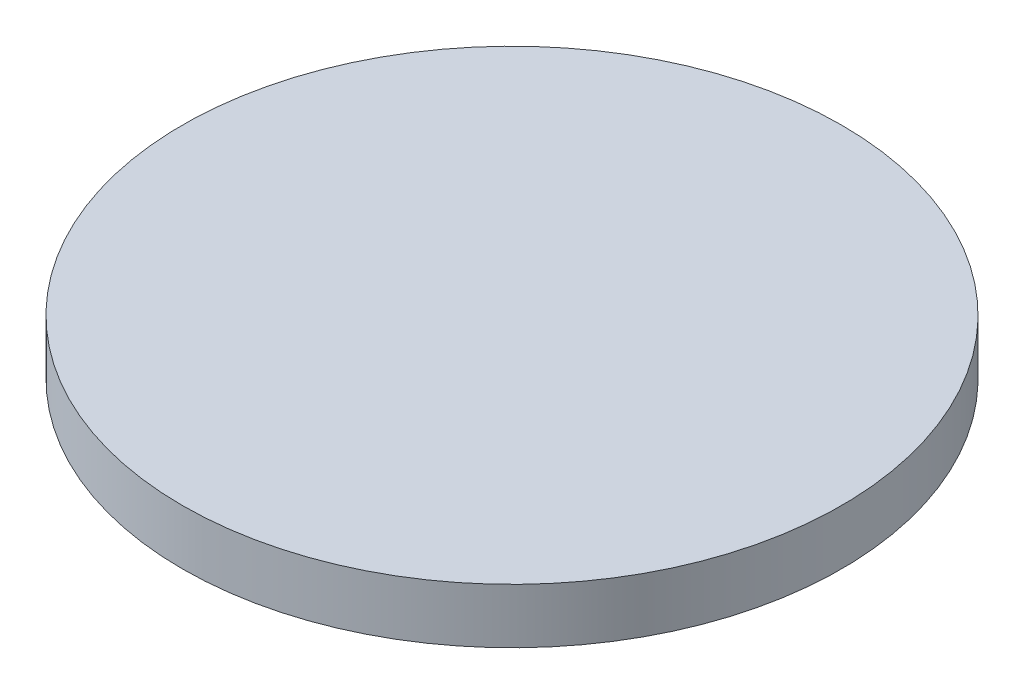
ISO-10303-21;
HEADER;
FILE_DESCRIPTION(('STEP AP214'),'2;1');
FILE_NAME('part.step','',(''),(''),'','','');
FILE_SCHEMA(('AUTOMOTIVE_DESIGN { 1 0 10303 214 1 1 1 1 }'));
ENDSEC;
DATA;
#1=APPLICATION_CONTEXT('core data for automotive mechanical design processes');
#2=APPLICATION_PROTOCOL_DEFINITION('international standard','automotive_design',2000,#1);
#3=PRODUCT_CONTEXT('',#1,'mechanical');
#4=PRODUCT('Part','Part','',(#3));
#5=PRODUCT_RELATED_PRODUCT_CATEGORY('part','',(#4));
#6=PRODUCT_DEFINITION_FORMATION('','',#4);
#7=PRODUCT_DEFINITION_CONTEXT('part definition',#1,'design');
#8=PRODUCT_DEFINITION('design','',#6,#7);
#9=PRODUCT_DEFINITION_SHAPE('','',#8);
#10=(LENGTH_UNIT() NAMED_UNIT(*) SI_UNIT(.MILLI.,.METRE.));
#11=(NAMED_UNIT(*) PLANE_ANGLE_UNIT() SI_UNIT($,.RADIAN.));
#12=(NAMED_UNIT(*) SI_UNIT($,.STERADIAN.) SOLID_ANGLE_UNIT());
#13=UNCERTAINTY_MEASURE_WITH_UNIT(LENGTH_MEASURE(1.E-05),#10,'distance_accuracy_value','');
#14=(GEOMETRIC_REPRESENTATION_CONTEXT(3) GLOBAL_UNCERTAINTY_ASSIGNED_CONTEXT((#13)) GLOBAL_UNIT_ASSIGNED_CONTEXT((#10,
#11,#12)) REPRESENTATION_CONTEXT('',''));
#15=CARTESIAN_POINT('',(0.,0.,0.));
#16=DIRECTION('',(0.,0.,1.));
#17=DIRECTION('',(1.,0.,0.));
#18=AXIS2_PLACEMENT_3D('',#15,#16,#17);
#19=CARTESIAN_POINT('',(12.,0.,0.));
#20=DIRECTION('',(0.,1.,0.));
#21=DIRECTION('',(0.,0.,1.));
#22=AXIS2_PLACEMENT_3D('',#19,#20,#21);
#23=PLANE('',#22);
#24=CARTESIAN_POINT('',(0.,0.,0.));
#25=DIRECTION('',(0.,1.,0.));
#26=DIRECTION('',(0.,0.,1.));
#27=AXIS2_PLACEMENT_3D('',#24,#25,#26);
#28=CIRCLE('',#27,12.);
#29=CARTESIAN_POINT('',(0.,0.,12.));
#30=VERTEX_POINT('',#29);
#31=EDGE_CURVE('E37',#30,#30,#28,.T.);
#32=ORIENTED_EDGE('',*,*,#31,.F.);
#33=EDGE_LOOP('',(#32));
#34=FACE_BOUND('',#33,.T.);
#35=ADVANCED_FACE('F31',(#34),#23,.F.);
#36=CARTESIAN_POINT('',(0.,2.,0.));
#37=DIRECTION('',(0.,-1.,0.));
#38=DIRECTION('',(0.,0.,-1.));
#39=AXIS2_PLACEMENT_3D('',#36,#37,#38);
#40=PLANE('',#39);
#41=CARTESIAN_POINT('',(0.,2.,0.));
#42=DIRECTION('',(0.,1.,0.));
#43=DIRECTION('',(0.,0.,1.));
#44=AXIS2_PLACEMENT_3D('',#41,#42,#43);
#45=CIRCLE('',#44,12.);
#46=CARTESIAN_POINT('',(0.,2.,12.));
#47=VERTEX_POINT('',#46);
#48=EDGE_CURVE('E10',#47,#47,#45,.T.);
#49=ORIENTED_EDGE('',*,*,#48,.T.);
#50=EDGE_LOOP('',(#49));
#51=FACE_BOUND('',#50,.T.);
#52=ADVANCED_FACE('F46',(#51),#40,.F.);
#53=CARTESIAN_POINT('',(0.,5.1404958677686,0.));
#54=DIRECTION('',(0.,1.,0.));
#55=DIRECTION('',(0.,0.,1.));
#56=AXIS2_PLACEMENT_3D('',#53,#54,#55);
#57=CYLINDRICAL_SURFACE('',#56,12.);
#58=ORIENTED_EDGE('',*,*,#48,.F.);
#59=EDGE_LOOP('',(#58));
#60=FACE_BOUND('',#59,.T.);
#61=ORIENTED_EDGE('',*,*,#31,.T.);
#62=EDGE_LOOP('',(#61));
#63=FACE_BOUND('',#62,.T.);
#64=ADVANCED_FACE('F43',(#60,#63),#57,.T.);
#65=CLOSED_SHELL('',(#35,#52,#64));
#66=MANIFOLD_SOLID_BREP('B2',#65);
#67=ADVANCED_BREP_SHAPE_REPRESENTATION('',(#18,#66),#14);
#68=SHAPE_DEFINITION_REPRESENTATION(#9,#67);
ENDSEC;
END-ISO-10303-21;
